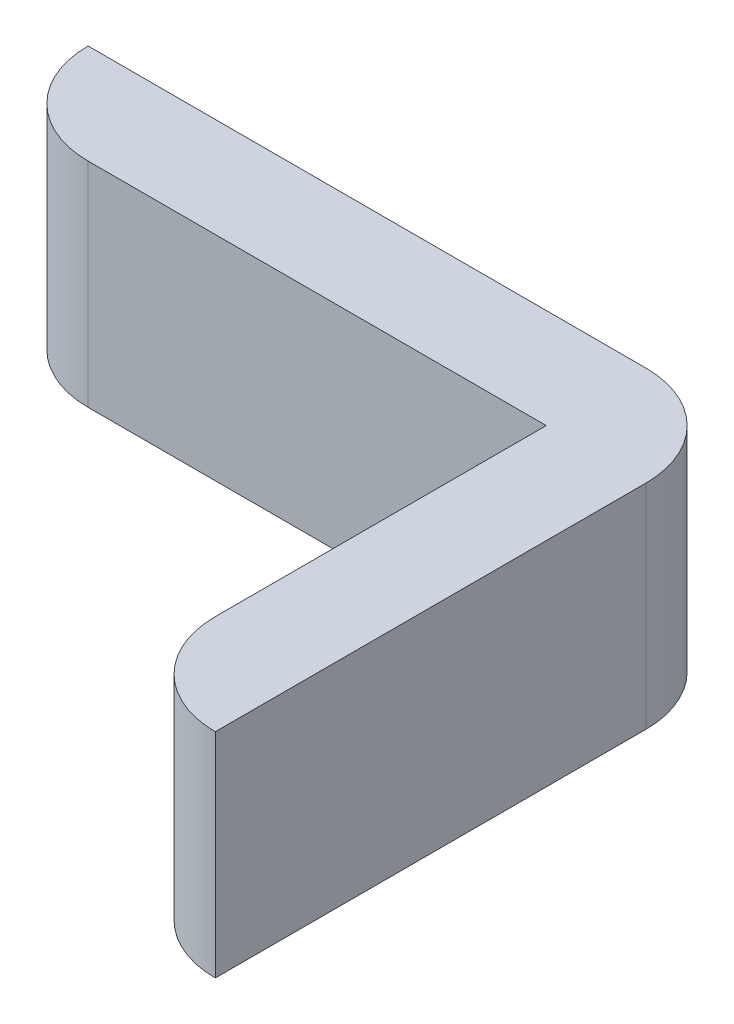
ISO-10303-21;
HEADER;
FILE_DESCRIPTION(('STEP AP214'),'2;1');
FILE_NAME('part.step','',(''),(''),'','','');
FILE_SCHEMA(('AUTOMOTIVE_DESIGN { 1 0 10303 214 1 1 1 1 }'));
ENDSEC;
DATA;
#1=APPLICATION_CONTEXT('core data for automotive mechanical design processes');
#2=APPLICATION_PROTOCOL_DEFINITION('international standard','automotive_design',2000,#1);
#3=PRODUCT_CONTEXT('',#1,'mechanical');
#4=PRODUCT('Part','Part','',(#3));
#5=PRODUCT_RELATED_PRODUCT_CATEGORY('part','',(#4));
#6=PRODUCT_DEFINITION_FORMATION('','',#4);
#7=PRODUCT_DEFINITION_CONTEXT('part definition',#1,'design');
#8=PRODUCT_DEFINITION('design','',#6,#7);
#9=PRODUCT_DEFINITION_SHAPE('','',#8);
#10=(LENGTH_UNIT() NAMED_UNIT(*) SI_UNIT(.MILLI.,.METRE.));
#11=(NAMED_UNIT(*) PLANE_ANGLE_UNIT() SI_UNIT($,.RADIAN.));
#12=(NAMED_UNIT(*) SI_UNIT($,.STERADIAN.) SOLID_ANGLE_UNIT());
#13=UNCERTAINTY_MEASURE_WITH_UNIT(LENGTH_MEASURE(1.E-05),#10,'distance_accuracy_value','');
#14=(GEOMETRIC_REPRESENTATION_CONTEXT(3) GLOBAL_UNCERTAINTY_ASSIGNED_CONTEXT((#13)) GLOBAL_UNIT_ASSIGNED_CONTEXT((#10,
#11,#12)) REPRESENTATION_CONTEXT('',''));
#15=CARTESIAN_POINT('',(0.,0.,0.));
#16=DIRECTION('',(0.,0.,1.));
#17=DIRECTION('',(1.,0.,0.));
#18=AXIS2_PLACEMENT_3D('',#15,#16,#17);
#19=CARTESIAN_POINT('',(4.1275,0.3675,1.33));
#20=DIRECTION('',(-1.,0.,0.));
#21=DIRECTION('',(0.,0.,1.));
#22=AXIS2_PLACEMENT_3D('',#19,#20,#21);
#23=PLANE('',#22);
#24=DIRECTION('',(0.,0.,-1.));
#25=VECTOR('',#24,1.);
#26=CARTESIAN_POINT('',(4.1275,0.3675,0.));
#27=LINE('',#26,#25);
#28=CARTESIAN_POINT('',(4.1275,0.3675,0.25));
#29=VERTEX_POINT('',#28);
#30=CARTESIAN_POINT('',(4.1275,0.3675,1.33));
#31=VERTEX_POINT('',#30);
#32=EDGE_CURVE('E129',#29,#31,#27,.F.);
#33=ORIENTED_EDGE('',*,*,#32,.F.);
#34=DIRECTION('',(0.,-1.,0.));
#35=VECTOR('',#34,1.);
#36=CARTESIAN_POINT('',(4.1275,0.3675,0.25));
#37=LINE('',#36,#35);
#38=CARTESIAN_POINT('',(4.1275,0.9025,0.25));
#39=VERTEX_POINT('',#38);
#40=EDGE_CURVE('E82',#39,#29,#37,.T.);
#41=ORIENTED_EDGE('',*,*,#40,.F.);
#42=DIRECTION('',(0.,0.,-1.));
#43=VECTOR('',#42,1.);
#44=CARTESIAN_POINT('',(4.1275,0.9025,0.));
#45=LINE('',#44,#43);
#46=CARTESIAN_POINT('',(4.1275,0.9025,1.33));
#47=VERTEX_POINT('',#46);
#48=EDGE_CURVE('E77',#39,#47,#45,.F.);
#49=ORIENTED_EDGE('',*,*,#48,.T.);
#50=DIRECTION('',(0.,-1.,0.));
#51=VECTOR('',#50,1.);
#52=CARTESIAN_POINT('',(4.1275,0.3675,1.33));
#53=LINE('',#52,#51);
#54=EDGE_CURVE('E123',#31,#47,#53,.F.);
#55=ORIENTED_EDGE('',*,*,#54,.F.);
#56=EDGE_LOOP('',(#33,#41,#49,#55));
#57=FACE_BOUND('',#56,.T.);
#58=ADVANCED_FACE('F17',(#57),#23,.F.);
#59=CARTESIAN_POINT('',(4.1275,0.3675,1.08));
#60=DIRECTION('',(0.,-1.,0.));
#61=DIRECTION('',(0.,0.,-1.));
#62=AXIS2_PLACEMENT_3D('',#59,#60,#61);
#63=CYLINDRICAL_SURFACE('',#62,0.25);
#64=CARTESIAN_POINT('',(4.1275,0.9025,1.08));
#65=DIRECTION('',(0.,-1.,0.));
#66=DIRECTION('',(0.,0.,-1.));
#67=AXIS2_PLACEMENT_3D('',#64,#65,#66);
#68=CIRCLE('',#67,0.25);
#69=CARTESIAN_POINT('',(3.8775,0.9025,1.08));
#70=VERTEX_POINT('',#69);
#71=EDGE_CURVE('E107',#47,#70,#68,.T.);
#72=ORIENTED_EDGE('',*,*,#71,.T.);
#73=DIRECTION('',(0.,1.,0.));
#74=VECTOR('',#73,1.);
#75=CARTESIAN_POINT('',(3.8775,0.3675,1.08));
#76=LINE('',#75,#74);
#77=CARTESIAN_POINT('',(3.8775,0.3675,1.08));
#78=VERTEX_POINT('',#77);
#79=EDGE_CURVE('E118',#70,#78,#76,.F.);
#80=ORIENTED_EDGE('',*,*,#79,.T.);
#81=CARTESIAN_POINT('',(4.1275,0.3675,1.08));
#82=DIRECTION('',(0.,-1.,0.));
#83=DIRECTION('',(0.,0.,-1.));
#84=AXIS2_PLACEMENT_3D('',#81,#82,#83);
#85=CIRCLE('',#84,0.25);
#86=EDGE_CURVE('E126',#31,#78,#85,.T.);
#87=ORIENTED_EDGE('',*,*,#86,.F.);
#88=ORIENTED_EDGE('',*,*,#54,.T.);
#89=EDGE_LOOP('',(#72,#80,#87,#88));
#90=FACE_BOUND('',#89,.T.);
#91=ADVANCED_FACE('F133',(#90),#63,.T.);
#92=CARTESIAN_POINT('',(3.8775,0.3675,0.25));
#93=DIRECTION('',(1.,0.,0.));
#94=DIRECTION('',(0.,0.,-1.));
#95=AXIS2_PLACEMENT_3D('',#92,#93,#94);
#96=PLANE('',#95);
#97=ORIENTED_EDGE('',*,*,#79,.F.);
#98=DIRECTION('',(0.,0.,-1.));
#99=VECTOR('',#98,1.);
#100=CARTESIAN_POINT('',(3.8775,0.9025,0.));
#101=LINE('',#100,#99);
#102=CARTESIAN_POINT('',(3.8775,0.9025,0.25));
#103=VERTEX_POINT('',#102);
#104=EDGE_CURVE('E102',#70,#103,#101,.T.);
#105=ORIENTED_EDGE('',*,*,#104,.T.);
#106=DIRECTION('',(0.,1.,0.));
#107=VECTOR('',#106,1.);
#108=CARTESIAN_POINT('',(3.8775,0.3675,0.25));
#109=LINE('',#108,#107);
#110=CARTESIAN_POINT('',(3.8775,0.3675,0.25));
#111=VERTEX_POINT('',#110);
#112=EDGE_CURVE('E115',#103,#111,#109,.F.);
#113=ORIENTED_EDGE('',*,*,#112,.T.);
#114=DIRECTION('',(0.,0.,-1.));
#115=VECTOR('',#114,1.);
#116=CARTESIAN_POINT('',(3.8775,0.3675,0.));
#117=LINE('',#116,#115);
#118=EDGE_CURVE('E128',#78,#111,#117,.T.);
#119=ORIENTED_EDGE('',*,*,#118,.F.);
#120=EDGE_LOOP('',(#97,#105,#113,#119));
#121=FACE_BOUND('',#120,.T.);
#122=ADVANCED_FACE('F158',(#121),#96,.F.);
#123=CARTESIAN_POINT('',(2.7285,0.3675,0.25));
#124=DIRECTION('',(0.,0.,-1.));
#125=DIRECTION('',(-1.,0.,0.));
#126=AXIS2_PLACEMENT_3D('',#123,#124,#125);
#127=PLANE('',#126);
#128=ORIENTED_EDGE('',*,*,#112,.F.);
#129=DIRECTION('',(1.,0.,0.));
#130=VECTOR('',#129,1.);
#131=CARTESIAN_POINT('',(2.4785,0.9025,0.25));
#132=LINE('',#131,#130);
#133=CARTESIAN_POINT('',(2.7285,0.9025,0.25));
#134=VERTEX_POINT('',#133);
#135=EDGE_CURVE('E98',#103,#134,#132,.F.);
#136=ORIENTED_EDGE('',*,*,#135,.T.);
#137=DIRECTION('',(0.,-1.,0.));
#138=VECTOR('',#137,1.);
#139=CARTESIAN_POINT('',(2.7285,0.3675,0.25));
#140=LINE('',#139,#138);
#141=CARTESIAN_POINT('',(2.7285,0.3675,0.25));
#142=VERTEX_POINT('',#141);
#143=EDGE_CURVE('E101',#142,#134,#140,.F.);
#144=ORIENTED_EDGE('',*,*,#143,.F.);
#145=DIRECTION('',(1.,0.,0.));
#146=VECTOR('',#145,1.);
#147=CARTESIAN_POINT('',(2.4785,0.3675,0.25));
#148=LINE('',#147,#146);
#149=EDGE_CURVE('E94',#111,#142,#148,.F.);
#150=ORIENTED_EDGE('',*,*,#149,.F.);
#151=EDGE_LOOP('',(#128,#136,#144,#150));
#152=FACE_BOUND('',#151,.T.);
#153=ADVANCED_FACE('F156',(#152),#127,.F.);
#154=CARTESIAN_POINT('',(3.8775,0.3675,0.25));
#155=DIRECTION('',(0.,-1.,0.));
#156=DIRECTION('',(0.,0.,-1.));
#157=AXIS2_PLACEMENT_3D('',#154,#155,#156);
#158=CYLINDRICAL_SURFACE('',#157,0.25);
#159=CARTESIAN_POINT('',(3.8775,0.9025,0.25));
#160=DIRECTION('',(0.,-1.,0.));
#161=DIRECTION('',(0.,0.,-1.));
#162=AXIS2_PLACEMENT_3D('',#159,#160,#161);
#163=CIRCLE('',#162,0.25);
#164=CARTESIAN_POINT('',(3.8775,0.9025,0.));
#165=VERTEX_POINT('',#164);
#166=EDGE_CURVE('E20',#165,#39,#163,.T.);
#167=ORIENTED_EDGE('',*,*,#166,.T.);
#168=ORIENTED_EDGE('',*,*,#40,.T.);
#169=CARTESIAN_POINT('',(3.8775,0.3675,0.25));
#170=DIRECTION('',(0.,-1.,0.));
#171=DIRECTION('',(0.,0.,-1.));
#172=AXIS2_PLACEMENT_3D('',#169,#170,#171);
#173=CIRCLE('',#172,0.25);
#174=CARTESIAN_POINT('',(3.8775,0.3675,0.));
#175=VERTEX_POINT('',#174);
#176=EDGE_CURVE('E92',#175,#29,#173,.T.);
#177=ORIENTED_EDGE('',*,*,#176,.F.);
#178=DIRECTION('',(0.,1.,0.));
#179=VECTOR('',#178,1.);
#180=CARTESIAN_POINT('',(3.8775,0.3675,0.));
#181=LINE('',#180,#179);
#182=EDGE_CURVE('E86',#175,#165,#181,.T.);
#183=ORIENTED_EDGE('',*,*,#182,.T.);
#184=EDGE_LOOP('',(#167,#168,#177,#183));
#185=FACE_BOUND('',#184,.T.);
#186=ADVANCED_FACE('F90',(#185),#158,.T.);
#187=CARTESIAN_POINT('',(2.4785,0.9025,0.));
#188=DIRECTION('',(0.,-1.,0.));
#189=DIRECTION('',(0.,0.,-1.));
#190=AXIS2_PLACEMENT_3D('',#187,#188,#189);
#191=PLANE('',#190);
#192=ORIENTED_EDGE('',*,*,#135,.F.);
#193=ORIENTED_EDGE('',*,*,#104,.F.);
#194=ORIENTED_EDGE('',*,*,#71,.F.);
#195=ORIENTED_EDGE('',*,*,#48,.F.);
#196=ORIENTED_EDGE('',*,*,#166,.F.);
#197=DIRECTION('',(1.,0.,0.));
#198=VECTOR('',#197,1.);
#199=CARTESIAN_POINT('',(3.8775,0.9025,0.));
#200=LINE('',#199,#198);
#201=CARTESIAN_POINT('',(2.4785,0.9025,0.));
#202=VERTEX_POINT('',#201);
#203=EDGE_CURVE('E74',#165,#202,#200,.F.);
#204=ORIENTED_EDGE('',*,*,#203,.T.);
#205=CARTESIAN_POINT('',(2.7285,0.9025,0.));
#206=DIRECTION('',(0.,-1.,0.));
#207=DIRECTION('',(0.,0.,-1.));
#208=AXIS2_PLACEMENT_3D('',#205,#206,#207);
#209=CIRCLE('',#208,0.25);
#210=EDGE_CURVE('E114',#134,#202,#209,.T.);
#211=ORIENTED_EDGE('',*,*,#210,.F.);
#212=EDGE_LOOP('',(#192,#193,#194,#195,#196,#204,#211));
#213=FACE_BOUND('',#212,.T.);
#214=ADVANCED_FACE('F72',(#213),#191,.F.);
#215=CARTESIAN_POINT('',(2.7285,0.3675,0.));
#216=DIRECTION('',(0.,-1.,0.));
#217=DIRECTION('',(0.,0.,-1.));
#218=AXIS2_PLACEMENT_3D('',#215,#216,#217);
#219=CYLINDRICAL_SURFACE('',#218,0.25);
#220=ORIENTED_EDGE('',*,*,#210,.T.);
#221=DIRECTION('',(0.,1.,0.));
#222=VECTOR('',#221,1.);
#223=CARTESIAN_POINT('',(2.4785,0.3675,0.));
#224=LINE('',#223,#222);
#225=CARTESIAN_POINT('',(2.4785,0.3675,0.));
#226=VERTEX_POINT('',#225);
#227=EDGE_CURVE('E26',#202,#226,#224,.F.);
#228=ORIENTED_EDGE('',*,*,#227,.T.);
#229=CARTESIAN_POINT('',(2.7285,0.3675,0.));
#230=DIRECTION('',(0.,-1.,0.));
#231=DIRECTION('',(0.,0.,-1.));
#232=AXIS2_PLACEMENT_3D('',#229,#230,#231);
#233=CIRCLE('',#232,0.25);
#234=EDGE_CURVE('E34',#142,#226,#233,.T.);
#235=ORIENTED_EDGE('',*,*,#234,.F.);
#236=ORIENTED_EDGE('',*,*,#143,.T.);
#237=EDGE_LOOP('',(#220,#228,#235,#236));
#238=FACE_BOUND('',#237,.T.);
#239=ADVANCED_FACE('F141',(#238),#219,.T.);
#240=CARTESIAN_POINT('',(2.4785,0.3675,0.));
#241=DIRECTION('',(0.,-1.,0.));
#242=DIRECTION('',(0.,0.,-1.));
#243=AXIS2_PLACEMENT_3D('',#240,#241,#242);
#244=PLANE('',#243);
#245=ORIENTED_EDGE('',*,*,#149,.T.);
#246=ORIENTED_EDGE('',*,*,#234,.T.);
#247=DIRECTION('',(1.,0.,0.));
#248=VECTOR('',#247,1.);
#249=CARTESIAN_POINT('',(3.8775,0.3675,0.));
#250=LINE('',#249,#248);
#251=EDGE_CURVE('E11',#226,#175,#250,.T.);
#252=ORIENTED_EDGE('',*,*,#251,.T.);
#253=ORIENTED_EDGE('',*,*,#176,.T.);
#254=ORIENTED_EDGE('',*,*,#32,.T.);
#255=ORIENTED_EDGE('',*,*,#86,.T.);
#256=ORIENTED_EDGE('',*,*,#118,.T.);
#257=EDGE_LOOP('',(#245,#246,#252,#253,#254,#255,#256));
#258=FACE_BOUND('',#257,.T.);
#259=ADVANCED_FACE('F139',(#258),#244,.T.);
#260=CARTESIAN_POINT('',(3.8775,0.3675,0.));
#261=DIRECTION('',(0.,0.,1.));
#262=DIRECTION('',(1.,0.,0.));
#263=AXIS2_PLACEMENT_3D('',#260,#261,#262);
#264=PLANE('',#263);
#265=ORIENTED_EDGE('',*,*,#227,.F.);
#266=ORIENTED_EDGE('',*,*,#203,.F.);
#267=ORIENTED_EDGE('',*,*,#182,.F.);
#268=ORIENTED_EDGE('',*,*,#251,.F.);
#269=EDGE_LOOP('',(#265,#266,#267,#268));
#270=FACE_BOUND('',#269,.T.);
#271=ADVANCED_FACE('F85',(#270),#264,.F.);
#272=CLOSED_SHELL('',(#58,#91,#122,#153,#186,#214,#239,#259,#271));
#273=MANIFOLD_SOLID_BREP('B1',#272);
#274=ADVANCED_BREP_SHAPE_REPRESENTATION('',(#18,#273),#14);
#275=SHAPE_DEFINITION_REPRESENTATION(#9,#274);
ENDSEC;
END-ISO-10303-21;
